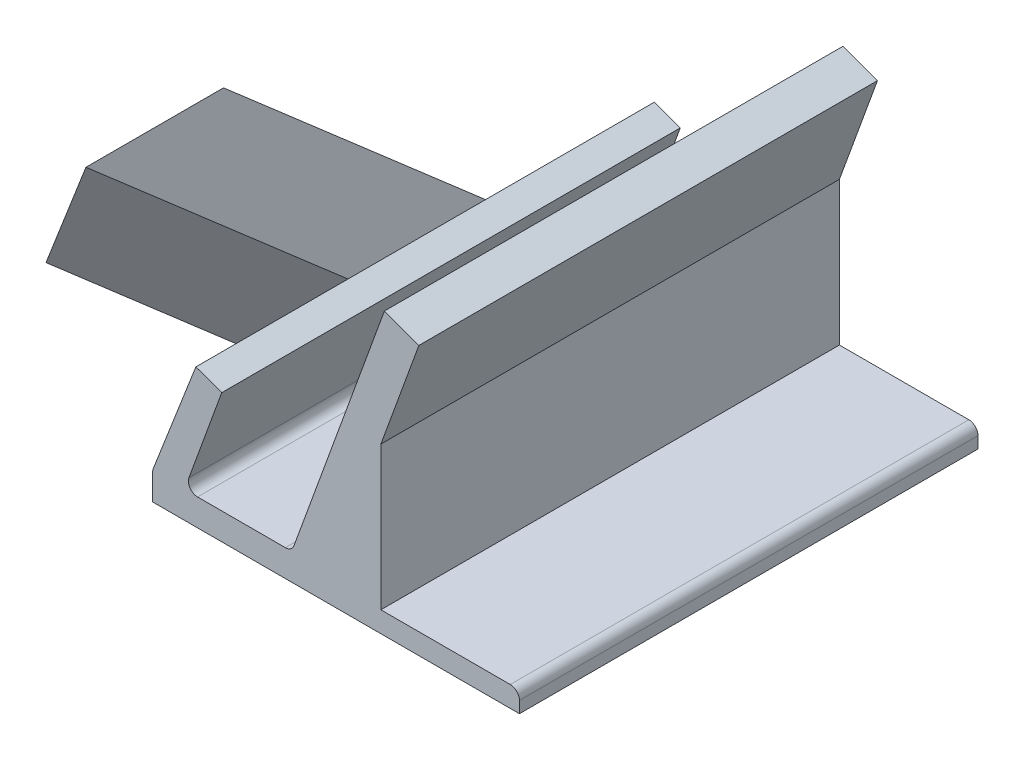
ISO-10303-21;
HEADER;
FILE_DESCRIPTION(('STEP AP214'),'2;1');
FILE_NAME('part.step','',(''),(''),'','','');
FILE_SCHEMA(('AUTOMOTIVE_DESIGN { 1 0 10303 214 1 1 1 1 }'));
ENDSEC;
DATA;
#1=APPLICATION_CONTEXT('core data for automotive mechanical design processes');
#2=APPLICATION_PROTOCOL_DEFINITION('international standard','automotive_design',2000,#1);
#3=PRODUCT_CONTEXT('',#1,'mechanical');
#4=PRODUCT('Part','Part','',(#3));
#5=PRODUCT_RELATED_PRODUCT_CATEGORY('part','',(#4));
#6=PRODUCT_DEFINITION_FORMATION('','',#4);
#7=PRODUCT_DEFINITION_CONTEXT('part definition',#1,'design');
#8=PRODUCT_DEFINITION('design','',#6,#7);
#9=PRODUCT_DEFINITION_SHAPE('','',#8);
#10=(LENGTH_UNIT() NAMED_UNIT(*) SI_UNIT(.MILLI.,.METRE.));
#11=(NAMED_UNIT(*) PLANE_ANGLE_UNIT() SI_UNIT($,.RADIAN.));
#12=(NAMED_UNIT(*) SI_UNIT($,.STERADIAN.) SOLID_ANGLE_UNIT());
#13=UNCERTAINTY_MEASURE_WITH_UNIT(LENGTH_MEASURE(1.E-05),#10,'distance_accuracy_value','');
#14=(GEOMETRIC_REPRESENTATION_CONTEXT(3) GLOBAL_UNCERTAINTY_ASSIGNED_CONTEXT((#13)) GLOBAL_UNIT_ASSIGNED_CONTEXT((#10,
#11,#12)) REPRESENTATION_CONTEXT('',''));
#15=CARTESIAN_POINT('',(0.,0.,0.));
#16=DIRECTION('',(0.,0.,1.));
#17=DIRECTION('',(1.,0.,0.));
#18=AXIS2_PLACEMENT_3D('',#15,#16,#17);
#19=CARTESIAN_POINT('',(-84.4243498751741,-3.74669119484268,50.));
#20=DIRECTION('',(0.93181597119698,-0.362931117186484,0.));
#21=DIRECTION('',(0.362931117186484,0.93181597119698,0.));
#22=AXIS2_PLACEMENT_3D('',#19,#20,#21);
#23=PLANE('',#22);
#24=DIRECTION('',(-0.362931117186484,-0.93181597119698,0.));
#25=VECTOR('',#24,1.);
#26=CARTESIAN_POINT('',(-80.0992581448051,7.35786655840973,17.5));
#27=LINE('',#26,#25);
#28=CARTESIAN_POINT('',(-80.0992581448051,7.35786655840973,17.5));
#29=VERTEX_POINT('',#28);
#30=CARTESIAN_POINT('',(-84.424349875174,-3.74669119484269,17.5));
#31=VERTEX_POINT('',#30);
#32=EDGE_CURVE('E316',#29,#31,#27,.T.);
#33=ORIENTED_EDGE('',*,*,#32,.F.);
#34=DIRECTION('',(0.,0.,1.));
#35=VECTOR('',#34,1.);
#36=CARTESIAN_POINT('',(-80.0992581448051,7.35786655840973,17.5));
#37=LINE('',#36,#35);
#38=CARTESIAN_POINT('',(-80.0992581448051,7.35786655840973,32.5));
#39=VERTEX_POINT('',#38);
#40=EDGE_CURVE('E329',#29,#39,#37,.T.);
#41=ORIENTED_EDGE('',*,*,#40,.T.);
#42=DIRECTION('',(-0.362931117186484,-0.93181597119698,0.));
#43=VECTOR('',#42,1.);
#44=CARTESIAN_POINT('',(-80.0992581448051,7.35786655840973,32.5));
#45=LINE('',#44,#43);
#46=CARTESIAN_POINT('',(-84.4243498751741,-3.74669119484268,32.5));
#47=VERTEX_POINT('',#46);
#48=EDGE_CURVE('E326',#39,#47,#45,.T.);
#49=ORIENTED_EDGE('',*,*,#48,.T.);
#50=DIRECTION('',(0.,0.,-1.));
#51=VECTOR('',#50,1.);
#52=CARTESIAN_POINT('',(-84.4243498751741,-3.74669119484268,50.));
#53=LINE('',#52,#51);
#54=CARTESIAN_POINT('',(-84.4243498751741,-3.74669119484268,50.));
#55=VERTEX_POINT('',#54);
#56=EDGE_CURVE('E181',#55,#47,#53,.T.);
#57=ORIENTED_EDGE('',*,*,#56,.F.);
#58=DIRECTION('',(-0.362931117186488,-0.931815971196978,0.));
#59=VECTOR('',#58,1.);
#60=CARTESIAN_POINT('',(-79.7744293805528,8.1918557538829,50.));
#61=LINE('',#60,#59);
#62=CARTESIAN_POINT('',(-79.7744293805528,8.1918557538829,50.));
#63=VERTEX_POINT('',#62);
#64=EDGE_CURVE('E164',#63,#55,#61,.T.);
#65=ORIENTED_EDGE('',*,*,#64,.F.);
#66=DIRECTION('',(0.,0.,-1.));
#67=VECTOR('',#66,1.);
#68=CARTESIAN_POINT('',(-79.7744293805528,8.1918557538829,50.));
#69=LINE('',#68,#67);
#70=CARTESIAN_POINT('',(-79.7744293805528,8.1918557538829,0.));
#71=VERTEX_POINT('',#70);
#72=EDGE_CURVE('E174',#63,#71,#69,.T.);
#73=ORIENTED_EDGE('',*,*,#72,.T.);
#74=DIRECTION('',(-0.362931117186484,-0.93181597119698,0.));
#75=VECTOR('',#74,1.);
#76=CARTESIAN_POINT('',(-84.4243498751741,-3.74669119484268,0.));
#77=LINE('',#76,#75);
#78=CARTESIAN_POINT('',(-84.4243498751741,-3.74669119484268,0.));
#79=VERTEX_POINT('',#78);
#80=EDGE_CURVE('E223',#71,#79,#77,.T.);
#81=ORIENTED_EDGE('',*,*,#80,.T.);
#82=EDGE_CURVE('E228',#31,#79,#53,.T.);
#83=ORIENTED_EDGE('',*,*,#82,.F.);
#84=EDGE_LOOP('',(#33,#41,#49,#57,#65,#73,#81,#83));
#85=FACE_BOUND('',#84,.T.);
#86=ADVANCED_FACE('F33',(#85),#23,.F.);
#87=CARTESIAN_POINT('',(-84.4925339039771,-6.92175187167785,50.));
#88=DIRECTION('',(1.,0.,0.));
#89=DIRECTION('',(0.,0.,-1.));
#90=AXIS2_PLACEMENT_3D('',#87,#88,#89);
#91=PLANE('',#90);
#92=DIRECTION('',(0.,-1.,0.));
#93=VECTOR('',#92,1.);
#94=CARTESIAN_POINT('',(-84.4925339039771,-6.92175187167785,0.));
#95=LINE('',#94,#93);
#96=CARTESIAN_POINT('',(-84.4925339039771,-4.10962231202917,0.));
#97=VERTEX_POINT('',#96);
#98=CARTESIAN_POINT('',(-84.4925339039771,-6.92175187167785,0.));
#99=VERTEX_POINT('',#98);
#100=EDGE_CURVE('E191',#97,#99,#95,.T.);
#101=ORIENTED_EDGE('',*,*,#100,.T.);
#102=DIRECTION('',(0.,0.,-1.));
#103=VECTOR('',#102,1.);
#104=CARTESIAN_POINT('',(-84.4925339039771,-6.92175187167785,50.));
#105=LINE('',#104,#103);
#106=CARTESIAN_POINT('',(-84.4925339039771,-6.92175187167785,50.));
#107=VERTEX_POINT('',#106);
#108=EDGE_CURVE('E11',#107,#99,#105,.T.);
#109=ORIENTED_EDGE('',*,*,#108,.F.);
#110=DIRECTION('',(0.,-1.,0.));
#111=VECTOR('',#110,1.);
#112=CARTESIAN_POINT('',(-84.4925339039771,-6.92175187167785,50.));
#113=LINE('',#112,#111);
#114=CARTESIAN_POINT('',(-84.4925339039771,-4.10962231202917,50.));
#115=VERTEX_POINT('',#114);
#116=EDGE_CURVE('E226',#115,#107,#113,.T.);
#117=ORIENTED_EDGE('',*,*,#116,.F.);
#118=DIRECTION('',(0.,0.,-1.));
#119=VECTOR('',#118,1.);
#120=CARTESIAN_POINT('',(-84.4925339039771,-4.10962231202917,50.));
#121=LINE('',#120,#119);
#122=EDGE_CURVE('E187',#115,#97,#121,.T.);
#123=ORIENTED_EDGE('',*,*,#122,.T.);
#124=EDGE_LOOP('',(#101,#109,#117,#123));
#125=FACE_BOUND('',#124,.T.);
#126=ADVANCED_FACE('F35',(#125),#91,.F.);
#127=CARTESIAN_POINT('',(-84.4925339039771,-6.92175187167785,50.));
#128=DIRECTION('',(0.,1.,0.));
#129=DIRECTION('',(0.,0.,1.));
#130=AXIS2_PLACEMENT_3D('',#127,#128,#129);
#131=PLANE('',#130);
#132=DIRECTION('',(1.,0.,0.));
#133=VECTOR('',#132,1.);
#134=CARTESIAN_POINT('',(-84.4925339039771,-6.92175187167785,0.));
#135=LINE('',#134,#133);
#136=CARTESIAN_POINT('',(-44.4925339039771,-6.92175187167785,0.));
#137=VERTEX_POINT('',#136);
#138=EDGE_CURVE('E194',#99,#137,#135,.T.);
#139=ORIENTED_EDGE('',*,*,#138,.T.);
#140=DIRECTION('',(0.,0.,-1.));
#141=VECTOR('',#140,1.);
#142=CARTESIAN_POINT('',(-44.4925339039771,-6.92175187167785,50.));
#143=LINE('',#142,#141);
#144=CARTESIAN_POINT('',(-44.4925339039771,-6.92175187167785,50.));
#145=VERTEX_POINT('',#144);
#146=EDGE_CURVE('E41',#145,#137,#143,.T.);
#147=ORIENTED_EDGE('',*,*,#146,.F.);
#148=DIRECTION('',(1.,0.,0.));
#149=VECTOR('',#148,1.);
#150=CARTESIAN_POINT('',(-84.4925339039771,-6.92175187167785,50.));
#151=LINE('',#150,#149);
#152=EDGE_CURVE('E121',#107,#145,#151,.T.);
#153=ORIENTED_EDGE('',*,*,#152,.F.);
#154=ORIENTED_EDGE('',*,*,#108,.T.);
#155=EDGE_LOOP('',(#139,#147,#153,#154));
#156=FACE_BOUND('',#155,.T.);
#157=ADVANCED_FACE('F354',(#156),#131,.F.);
#158=CARTESIAN_POINT('',(-44.4925339039771,-6.92175187167785,50.));
#159=DIRECTION('',(-1.,0.,0.));
#160=DIRECTION('',(0.,0.,1.));
#161=AXIS2_PLACEMENT_3D('',#158,#159,#160);
#162=PLANE('',#161);
#163=DIRECTION('',(0.,1.,0.));
#164=VECTOR('',#163,1.);
#165=CARTESIAN_POINT('',(-44.4925339039771,-6.92175187167785,0.));
#166=LINE('',#165,#164);
#167=CARTESIAN_POINT('',(-44.4925339039771,-5.66093221664552,0.));
#168=VERTEX_POINT('',#167);
#169=EDGE_CURVE('E197',#137,#168,#166,.T.);
#170=ORIENTED_EDGE('',*,*,#169,.T.);
#171=DIRECTION('',(0.,0.,-1.));
#172=VECTOR('',#171,1.);
#173=CARTESIAN_POINT('',(-44.4925339039771,-5.66093221664552,50.));
#174=LINE('',#173,#172);
#175=CARTESIAN_POINT('',(-44.4925339039771,-5.66093221664552,50.));
#176=VERTEX_POINT('',#175);
#177=EDGE_CURVE('E259',#176,#168,#174,.T.);
#178=ORIENTED_EDGE('',*,*,#177,.F.);
#179=DIRECTION('',(0.,1.,0.));
#180=VECTOR('',#179,1.);
#181=CARTESIAN_POINT('',(-44.4925339039771,-6.92175187167785,50.));
#182=LINE('',#181,#180);
#183=EDGE_CURVE('E267',#145,#176,#182,.T.);
#184=ORIENTED_EDGE('',*,*,#183,.F.);
#185=ORIENTED_EDGE('',*,*,#146,.T.);
#186=EDGE_LOOP('',(#170,#178,#184,#185));
#187=FACE_BOUND('',#186,.T.);
#188=ADVANCED_FACE('F265',(#187),#162,.F.);
#189=CARTESIAN_POINT('',(-45.4925339039771,-5.66093221664551,50.));
#190=DIRECTION('',(0.,0.,-1.));
#191=DIRECTION('',(-1.,0.,0.));
#192=AXIS2_PLACEMENT_3D('',#189,#190,#191);
#193=CYLINDRICAL_SURFACE('',#192,1.);
#194=CARTESIAN_POINT('',(-45.4925339039771,-5.66093221664551,0.));
#195=DIRECTION('',(0.,0.,1.));
#196=DIRECTION('',(1.,0.,0.));
#197=AXIS2_PLACEMENT_3D('',#194,#195,#196);
#198=CIRCLE('',#197,1.);
#199=CARTESIAN_POINT('',(-45.4925339039771,-4.66093221664551,0.));
#200=VERTEX_POINT('',#199);
#201=EDGE_CURVE('E199',#168,#200,#198,.T.);
#202=ORIENTED_EDGE('',*,*,#201,.T.);
#203=DIRECTION('',(0.,0.,-1.));
#204=VECTOR('',#203,1.);
#205=CARTESIAN_POINT('',(-45.4925339039771,-4.66093221664551,50.));
#206=LINE('',#205,#204);
#207=CARTESIAN_POINT('',(-45.4925339039771,-4.66093221664551,50.));
#208=VERTEX_POINT('',#207);
#209=EDGE_CURVE('E256',#208,#200,#206,.T.);
#210=ORIENTED_EDGE('',*,*,#209,.F.);
#211=CARTESIAN_POINT('',(-45.4925339039771,-5.66093221664551,50.));
#212=DIRECTION('',(0.,0.,1.));
#213=DIRECTION('',(1.,0.,0.));
#214=AXIS2_PLACEMENT_3D('',#211,#212,#213);
#215=CIRCLE('',#214,1.);
#216=EDGE_CURVE('E285',#176,#208,#215,.T.);
#217=ORIENTED_EDGE('',*,*,#216,.F.);
#218=ORIENTED_EDGE('',*,*,#177,.T.);
#219=EDGE_LOOP('',(#202,#210,#217,#218));
#220=FACE_BOUND('',#219,.T.);
#221=ADVANCED_FACE('F276',(#220),#193,.T.);
#222=CARTESIAN_POINT('',(-45.4925339039771,-4.66093221664551,50.));
#223=DIRECTION('',(0.,-1.,0.));
#224=DIRECTION('',(0.,0.,-1.));
#225=AXIS2_PLACEMENT_3D('',#222,#223,#224);
#226=PLANE('',#225);
#227=DIRECTION('',(-1.,0.,0.));
#228=VECTOR('',#227,1.);
#229=CARTESIAN_POINT('',(-45.4925339039771,-4.66093221664551,0.));
#230=LINE('',#229,#228);
#231=CARTESIAN_POINT('',(-59.6020973536628,-4.66093221664551,0.));
#232=VERTEX_POINT('',#231);
#233=EDGE_CURVE('E201',#200,#232,#230,.T.);
#234=ORIENTED_EDGE('',*,*,#233,.T.);
#235=DIRECTION('',(0.,0.,-1.));
#236=VECTOR('',#235,1.);
#237=CARTESIAN_POINT('',(-59.6020973536628,-4.66093221664551,50.));
#238=LINE('',#237,#236);
#239=CARTESIAN_POINT('',(-59.6020973536628,-4.66093221664551,50.));
#240=VERTEX_POINT('',#239);
#241=EDGE_CURVE('E253',#240,#232,#238,.T.);
#242=ORIENTED_EDGE('',*,*,#241,.F.);
#243=DIRECTION('',(-1.,0.,0.));
#244=VECTOR('',#243,1.);
#245=CARTESIAN_POINT('',(-45.4925339039771,-4.66093221664551,50.));
#246=LINE('',#245,#244);
#247=EDGE_CURVE('E282',#208,#240,#246,.T.);
#248=ORIENTED_EDGE('',*,*,#247,.F.);
#249=ORIENTED_EDGE('',*,*,#209,.T.);
#250=EDGE_LOOP('',(#234,#242,#248,#249));
#251=FACE_BOUND('',#250,.T.);
#252=ADVANCED_FACE('F280',(#251),#226,.F.);
#253=CARTESIAN_POINT('',(-59.6020973536628,-4.66093221664551,50.));
#254=DIRECTION('',(-1.,0.,0.));
#255=DIRECTION('',(0.,-1.,0.));
#256=AXIS2_PLACEMENT_3D('',#253,#254,#255);
#257=PLANE('',#256);
#258=DIRECTION('',(0.,1.,0.));
#259=VECTOR('',#258,1.);
#260=CARTESIAN_POINT('',(-59.6020973536628,-4.66093221664551,0.));
#261=LINE('',#260,#259);
#262=CARTESIAN_POINT('',(-59.6020973536625,10.9864032925687,0.));
#263=VERTEX_POINT('',#262);
#264=EDGE_CURVE('E203',#232,#263,#261,.T.);
#265=ORIENTED_EDGE('',*,*,#264,.T.);
#266=DIRECTION('',(0.,0.,-1.));
#267=VECTOR('',#266,1.);
#268=CARTESIAN_POINT('',(-59.6020973536625,10.9864032925687,50.));
#269=LINE('',#268,#267);
#270=CARTESIAN_POINT('',(-59.6020973536625,10.9864032925687,50.));
#271=VERTEX_POINT('',#270);
#272=EDGE_CURVE('E250',#271,#263,#269,.T.);
#273=ORIENTED_EDGE('',*,*,#272,.F.);
#274=DIRECTION('',(0.,1.,0.));
#275=VECTOR('',#274,1.);
#276=CARTESIAN_POINT('',(-59.6020973536628,-4.66093221664551,50.));
#277=LINE('',#276,#275);
#278=EDGE_CURVE('E284',#240,#271,#277,.T.);
#279=ORIENTED_EDGE('',*,*,#278,.F.);
#280=ORIENTED_EDGE('',*,*,#241,.T.);
#281=EDGE_LOOP('',(#265,#273,#279,#280));
#282=FACE_BOUND('',#281,.T.);
#283=ADVANCED_FACE('F393',(#282),#257,.F.);
#284=CARTESIAN_POINT('',(-55.4557081069991,22.3785141200469,50.));
#285=DIRECTION('',(-0.939692620785907,0.342020143325671,0.));
#286=DIRECTION('',(-0.342020143325671,-0.939692620785908,0.));
#287=AXIS2_PLACEMENT_3D('',#284,#285,#286);
#288=PLANE('',#287);
#289=DIRECTION('',(0.342020143325671,0.939692620785907,0.));
#290=VECTOR('',#289,1.);
#291=CARTESIAN_POINT('',(-55.4557081069991,22.3785141200469,0.));
#292=LINE('',#291,#290);
#293=CARTESIAN_POINT('',(-55.4557081069991,22.3785141200469,0.));
#294=VERTEX_POINT('',#293);
#295=EDGE_CURVE('E206',#263,#294,#292,.T.);
#296=ORIENTED_EDGE('',*,*,#295,.T.);
#297=DIRECTION('',(0.,0.,-1.));
#298=VECTOR('',#297,1.);
#299=CARTESIAN_POINT('',(-55.4557081069991,22.3785141200469,50.));
#300=LINE('',#299,#298);
#301=CARTESIAN_POINT('',(-55.4557081069991,22.3785141200469,50.));
#302=VERTEX_POINT('',#301);
#303=EDGE_CURVE('E247',#302,#294,#300,.T.);
#304=ORIENTED_EDGE('',*,*,#303,.F.);
#305=DIRECTION('',(0.342020143325638,0.93969262078592,0.));
#306=VECTOR('',#305,1.);
#307=CARTESIAN_POINT('',(-59.6020973536625,10.9864032925687,50.));
#308=LINE('',#307,#306);
#309=EDGE_CURVE('E287',#271,#302,#308,.T.);
#310=ORIENTED_EDGE('',*,*,#309,.F.);
#311=ORIENTED_EDGE('',*,*,#272,.T.);
#312=EDGE_LOOP('',(#296,#304,#310,#311));
#313=FACE_BOUND('',#312,.T.);
#314=ADVANCED_FACE('F389',(#313),#288,.F.);
#315=CARTESIAN_POINT('',(-59.2144785901427,23.7465946933495,50.));
#316=DIRECTION('',(-0.34202014332567,-0.939692620785908,0.));
#317=DIRECTION('',(0.939692620785908,-0.34202014332567,0.));
#318=AXIS2_PLACEMENT_3D('',#315,#316,#317);
#319=PLANE('',#318);
#320=DIRECTION('',(-0.939692620785908,0.34202014332567,0.));
#321=VECTOR('',#320,1.);
#322=CARTESIAN_POINT('',(-59.2144785901427,23.7465946933495,0.));
#323=LINE('',#322,#321);
#324=CARTESIAN_POINT('',(-59.2144785901427,23.7465946933495,0.));
#325=VERTEX_POINT('',#324);
#326=EDGE_CURVE('E208',#294,#325,#323,.T.);
#327=ORIENTED_EDGE('',*,*,#326,.T.);
#328=DIRECTION('',(0.,0.,-1.));
#329=VECTOR('',#328,1.);
#330=CARTESIAN_POINT('',(-59.2144785901427,23.7465946933495,50.));
#331=LINE('',#330,#329);
#332=CARTESIAN_POINT('',(-59.2144785901427,23.7465946933495,50.));
#333=VERTEX_POINT('',#332);
#334=EDGE_CURVE('E244',#333,#325,#331,.T.);
#335=ORIENTED_EDGE('',*,*,#334,.F.);
#336=DIRECTION('',(-0.939692620785908,0.34202014332567,0.));
#337=VECTOR('',#336,1.);
#338=CARTESIAN_POINT('',(-59.2144785901427,23.7465946933495,50.));
#339=LINE('',#338,#337);
#340=EDGE_CURVE('E293',#302,#333,#339,.T.);
#341=ORIENTED_EDGE('',*,*,#340,.F.);
#342=ORIENTED_EDGE('',*,*,#303,.T.);
#343=EDGE_LOOP('',(#327,#335,#341,#342));
#344=FACE_BOUND('',#343,.T.);
#345=ADVANCED_FACE('F385',(#344),#319,.F.);
#346=CARTESIAN_POINT('',(-69.0737024940638,-3.34140035602092,50.));
#347=DIRECTION('',(0.939692620785908,-0.34202014332567,0.));
#348=DIRECTION('',(0.34202014332567,0.939692620785908,0.));
#349=AXIS2_PLACEMENT_3D('',#346,#347,#348);
#350=PLANE('',#349);
#351=DIRECTION('',(-0.34202014332567,-0.939692620785908,0.));
#352=VECTOR('',#351,1.);
#353=CARTESIAN_POINT('',(-69.0737024940638,-3.34140035602092,0.));
#354=LINE('',#353,#352);
#355=CARTESIAN_POINT('',(-69.0737024940638,-3.34140035602092,0.));
#356=VERTEX_POINT('',#355);
#357=EDGE_CURVE('E211',#325,#356,#354,.T.);
#358=ORIENTED_EDGE('',*,*,#357,.T.);
#359=DIRECTION('',(0.,0.,-1.));
#360=VECTOR('',#359,1.);
#361=CARTESIAN_POINT('',(-69.0737024940638,-3.34140035602092,50.));
#362=LINE('',#361,#360);
#363=CARTESIAN_POINT('',(-69.0737024940638,-3.34140035602092,50.));
#364=VERTEX_POINT('',#363);
#365=EDGE_CURVE('E241',#364,#356,#362,.T.);
#366=ORIENTED_EDGE('',*,*,#365,.F.);
#367=DIRECTION('',(-0.34202014332567,-0.939692620785908,0.));
#368=VECTOR('',#367,1.);
#369=CARTESIAN_POINT('',(-59.5564987334684,22.8069020725636,50.));
#370=LINE('',#369,#368);
#371=EDGE_CURVE('E295',#333,#364,#370,.T.);
#372=ORIENTED_EDGE('',*,*,#371,.F.);
#373=ORIENTED_EDGE('',*,*,#334,.T.);
#374=EDGE_LOOP('',(#358,#366,#372,#373));
#375=FACE_BOUND('',#374,.T.);
#376=ADVANCED_FACE('F381',(#375),#350,.F.);
#377=CARTESIAN_POINT('',(-70.0133951148497,-2.99938021269526,50.));
#378=DIRECTION('',(0.,0.,-1.));
#379=DIRECTION('',(-1.,0.,0.));
#380=AXIS2_PLACEMENT_3D('',#377,#378,#379);
#381=CYLINDRICAL_SURFACE('',#380,1.);
#382=CARTESIAN_POINT('',(-70.0133951148497,-2.99938021269526,0.));
#383=DIRECTION('',(0.,0.,-1.));
#384=DIRECTION('',(1.,0.,0.));
#385=AXIS2_PLACEMENT_3D('',#382,#383,#384);
#386=CIRCLE('',#385,1.);
#387=CARTESIAN_POINT('',(-70.0133951148497,-3.99938021269526,0.));
#388=VERTEX_POINT('',#387);
#389=EDGE_CURVE('E213',#356,#388,#386,.T.);
#390=ORIENTED_EDGE('',*,*,#389,.T.);
#391=DIRECTION('',(0.,0.,-1.));
#392=VECTOR('',#391,1.);
#393=CARTESIAN_POINT('',(-70.0133951148497,-3.99938021269526,50.));
#394=LINE('',#393,#392);
#395=CARTESIAN_POINT('',(-70.0133951148497,-3.99938021269526,50.));
#396=VERTEX_POINT('',#395);
#397=EDGE_CURVE('E238',#396,#388,#394,.T.);
#398=ORIENTED_EDGE('',*,*,#397,.F.);
#399=CARTESIAN_POINT('',(-70.0133951148497,-2.99938021269526,50.));
#400=DIRECTION('',(0.,0.,-1.));
#401=DIRECTION('',(1.,0.,0.));
#402=AXIS2_PLACEMENT_3D('',#399,#400,#401);
#403=CIRCLE('',#402,1.);
#404=EDGE_CURVE('E297',#364,#396,#403,.T.);
#405=ORIENTED_EDGE('',*,*,#404,.F.);
#406=ORIENTED_EDGE('',*,*,#365,.T.);
#407=EDGE_LOOP('',(#390,#398,#405,#406));
#408=FACE_BOUND('',#407,.T.);
#409=ADVANCED_FACE('F377',(#408),#381,.F.);
#410=CARTESIAN_POINT('',(-79.590995067133,-3.99938021269526,50.));
#411=DIRECTION('',(0.,-1.,0.));
#412=DIRECTION('',(1.,0.,0.));
#413=AXIS2_PLACEMENT_3D('',#410,#411,#412);
#414=PLANE('',#413);
#415=DIRECTION('',(-1.,0.,0.));
#416=VECTOR('',#415,1.);
#417=CARTESIAN_POINT('',(-79.590995067133,-3.99938021269526,0.));
#418=LINE('',#417,#416);
#419=CARTESIAN_POINT('',(-79.590995067133,-3.99938021269526,0.));
#420=VERTEX_POINT('',#419);
#421=EDGE_CURVE('E215',#388,#420,#418,.T.);
#422=ORIENTED_EDGE('',*,*,#421,.T.);
#423=DIRECTION('',(0.,0.,-1.));
#424=VECTOR('',#423,1.);
#425=CARTESIAN_POINT('',(-79.590995067133,-3.99938021269526,50.));
#426=LINE('',#425,#424);
#427=CARTESIAN_POINT('',(-79.590995067133,-3.99938021269526,50.));
#428=VERTEX_POINT('',#427);
#429=EDGE_CURVE('E235',#428,#420,#426,.T.);
#430=ORIENTED_EDGE('',*,*,#429,.F.);
#431=DIRECTION('',(-1.,0.,0.));
#432=VECTOR('',#431,1.);
#433=CARTESIAN_POINT('',(-79.590995067133,-3.99938021269526,50.));
#434=LINE('',#433,#432);
#435=EDGE_CURVE('E299',#396,#428,#434,.T.);
#436=ORIENTED_EDGE('',*,*,#435,.F.);
#437=ORIENTED_EDGE('',*,*,#397,.T.);
#438=EDGE_LOOP('',(#422,#430,#436,#437));
#439=FACE_BOUND('',#438,.T.);
#440=ADVANCED_FACE('F374',(#439),#414,.F.);
#441=CARTESIAN_POINT('',(-79.590995067133,-2.99938021269526,50.));
#442=DIRECTION('',(0.,0.,-1.));
#443=DIRECTION('',(-1.,0.,0.));
#444=AXIS2_PLACEMENT_3D('',#441,#442,#443);
#445=CYLINDRICAL_SURFACE('',#444,0.999999999999998);
#446=CARTESIAN_POINT('',(-79.590995067133,-2.99938021269526,0.));
#447=DIRECTION('',(0.,0.,-1.));
#448=DIRECTION('',(1.,0.,0.));
#449=AXIS2_PLACEMENT_3D('',#446,#447,#448);
#450=CIRCLE('',#449,0.999999999999998);
#451=CARTESIAN_POINT('',(-80.5306876879189,-2.65736006936958,0.));
#452=VERTEX_POINT('',#451);
#453=EDGE_CURVE('E217',#420,#452,#450,.T.);
#454=ORIENTED_EDGE('',*,*,#453,.T.);
#455=DIRECTION('',(0.,0.,-1.));
#456=VECTOR('',#455,1.);
#457=CARTESIAN_POINT('',(-80.5306876879189,-2.65736006936958,50.));
#458=LINE('',#457,#456);
#459=CARTESIAN_POINT('',(-80.5306876879189,-2.65736006936958,50.));
#460=VERTEX_POINT('',#459);
#461=EDGE_CURVE('E232',#460,#452,#458,.T.);
#462=ORIENTED_EDGE('',*,*,#461,.F.);
#463=CARTESIAN_POINT('',(-79.590995067133,-2.99938021269526,50.));
#464=DIRECTION('',(0.,0.,-1.));
#465=DIRECTION('',(1.,0.,0.));
#466=AXIS2_PLACEMENT_3D('',#463,#464,#465);
#467=CIRCLE('',#466,0.999999999999998);
#468=EDGE_CURVE('E301',#428,#460,#467,.T.);
#469=ORIENTED_EDGE('',*,*,#468,.F.);
#470=ORIENTED_EDGE('',*,*,#429,.T.);
#471=EDGE_LOOP('',(#454,#462,#469,#470));
#472=FACE_BOUND('',#471,.T.);
#473=ADVANCED_FACE('F307',(#472),#445,.F.);
#474=CARTESIAN_POINT('',(-77.2973716615207,6.22610270311999,50.));
#475=DIRECTION('',(-0.939692620785908,0.34202014332567,0.));
#476=DIRECTION('',(-0.34202014332567,-0.939692620785908,0.));
#477=AXIS2_PLACEMENT_3D('',#474,#475,#476);
#478=PLANE('',#477);
#479=DIRECTION('',(0.34202014332567,0.939692620785908,0.));
#480=VECTOR('',#479,1.);
#481=CARTESIAN_POINT('',(-77.2973716615207,6.22610270311999,0.));
#482=LINE('',#481,#480);
#483=CARTESIAN_POINT('',(-76.9553515181951,7.1657953239059,0.));
#484=VERTEX_POINT('',#483);
#485=EDGE_CURVE('E220',#452,#484,#482,.T.);
#486=ORIENTED_EDGE('',*,*,#485,.T.);
#487=DIRECTION('',(0.,0.,-1.));
#488=VECTOR('',#487,1.);
#489=CARTESIAN_POINT('',(-76.9553515181951,7.1657953239059,50.));
#490=LINE('',#489,#488);
#491=CARTESIAN_POINT('',(-76.9553515181951,7.1657953239059,50.));
#492=VERTEX_POINT('',#491);
#493=EDGE_CURVE('E180',#492,#484,#490,.T.);
#494=ORIENTED_EDGE('',*,*,#493,.F.);
#495=DIRECTION('',(0.342020143325669,0.939692620785908,0.));
#496=VECTOR('',#495,1.);
#497=CARTESIAN_POINT('',(-77.2973716615207,6.22610270311999,50.));
#498=LINE('',#497,#496);
#499=EDGE_CURVE('E167',#460,#492,#498,.T.);
#500=ORIENTED_EDGE('',*,*,#499,.F.);
#501=ORIENTED_EDGE('',*,*,#461,.T.);
#502=EDGE_LOOP('',(#486,#494,#500,#501));
#503=FACE_BOUND('',#502,.T.);
#504=ADVANCED_FACE('F310',(#503),#478,.F.);
#505=CARTESIAN_POINT('',(-76.9553515181951,7.1657953239059,50.));
#506=DIRECTION('',(-0.342020143325669,-0.939692620785908,0.));
#507=DIRECTION('',(0.939692620785908,-0.342020143325669,0.));
#508=AXIS2_PLACEMENT_3D('',#505,#506,#507);
#509=PLANE('',#508);
#510=DIRECTION('',(-0.939692620785908,0.342020143325669,0.));
#511=VECTOR('',#510,1.);
#512=CARTESIAN_POINT('',(-76.9553515181951,7.1657953239059,0.));
#513=LINE('',#512,#511);
#514=EDGE_CURVE('E177',#484,#71,#513,.T.);
#515=ORIENTED_EDGE('',*,*,#514,.T.);
#516=ORIENTED_EDGE('',*,*,#72,.F.);
#517=DIRECTION('',(-0.939692620785908,0.342020143325669,0.));
#518=VECTOR('',#517,1.);
#519=CARTESIAN_POINT('',(-76.9553515181951,7.1657953239059,50.));
#520=LINE('',#519,#518);
#521=EDGE_CURVE('E160',#492,#63,#520,.T.);
#522=ORIENTED_EDGE('',*,*,#521,.F.);
#523=ORIENTED_EDGE('',*,*,#493,.T.);
#524=EDGE_LOOP('',(#515,#516,#522,#523));
#525=FACE_BOUND('',#524,.T.);
#526=ADVANCED_FACE('F175',(#525),#509,.F.);
#527=CARTESIAN_POINT('',(-83.4925339039771,-4.10962231202917,50.));
#528=DIRECTION('',(0.,0.,-1.));
#529=DIRECTION('',(-1.,0.,0.));
#530=AXIS2_PLACEMENT_3D('',#527,#528,#529);
#531=CYLINDRICAL_SURFACE('',#530,1.);
#532=CARTESIAN_POINT('',(-83.4925339039771,-4.10962231202917,0.));
#533=DIRECTION('',(0.,0.,1.));
#534=DIRECTION('',(-1.,0.,0.));
#535=AXIS2_PLACEMENT_3D('',#532,#533,#534);
#536=CIRCLE('',#535,1.);
#537=EDGE_CURVE('E113',#79,#97,#536,.T.);
#538=ORIENTED_EDGE('',*,*,#537,.T.);
#539=ORIENTED_EDGE('',*,*,#122,.F.);
#540=CARTESIAN_POINT('',(-83.4925339039771,-4.10962231202917,50.));
#541=DIRECTION('',(0.,0.,1.));
#542=DIRECTION('',(-1.,0.,0.));
#543=AXIS2_PLACEMENT_3D('',#540,#541,#542);
#544=CIRCLE('',#543,1.);
#545=EDGE_CURVE('E57',#55,#115,#544,.T.);
#546=ORIENTED_EDGE('',*,*,#545,.F.);
#547=ORIENTED_EDGE('',*,*,#56,.T.);
#548=EDGE_CURVE('E229',#47,#31,#53,.T.);
#549=ORIENTED_EDGE('',*,*,#548,.T.);
#550=ORIENTED_EDGE('',*,*,#82,.T.);
#551=EDGE_LOOP('',(#538,#539,#546,#547,#549,#550));
#552=FACE_BOUND('',#551,.T.);
#553=ADVANCED_FACE('F319',(#552),#531,.T.);
#554=CARTESIAN_POINT('',(-83.4925339039771,-4.10962231202917,50.));
#555=DIRECTION('',(0.,0.,-1.));
#556=DIRECTION('',(-1.,0.,0.));
#557=AXIS2_PLACEMENT_3D('',#554,#555,#556);
#558=PLANE('',#557);
#559=ORIENTED_EDGE('',*,*,#116,.T.);
#560=ORIENTED_EDGE('',*,*,#152,.T.);
#561=ORIENTED_EDGE('',*,*,#183,.T.);
#562=ORIENTED_EDGE('',*,*,#216,.T.);
#563=ORIENTED_EDGE('',*,*,#247,.T.);
#564=ORIENTED_EDGE('',*,*,#278,.T.);
#565=ORIENTED_EDGE('',*,*,#309,.T.);
#566=ORIENTED_EDGE('',*,*,#340,.T.);
#567=ORIENTED_EDGE('',*,*,#371,.T.);
#568=ORIENTED_EDGE('',*,*,#404,.T.);
#569=ORIENTED_EDGE('',*,*,#435,.T.);
#570=ORIENTED_EDGE('',*,*,#468,.T.);
#571=ORIENTED_EDGE('',*,*,#499,.T.);
#572=ORIENTED_EDGE('',*,*,#521,.T.);
#573=ORIENTED_EDGE('',*,*,#64,.T.);
#574=ORIENTED_EDGE('',*,*,#545,.T.);
#575=EDGE_LOOP('',(#559,#560,#561,#562,#563,#564,#565,#566,#567,#568,#569,#570,#571,#572,#573,#574));
#576=FACE_BOUND('',#575,.T.);
#577=ADVANCED_FACE('F162',(#576),#558,.F.);
#578=CARTESIAN_POINT('',(-83.4925339039771,-4.10962231202917,0.));
#579=DIRECTION('',(0.,0.,-1.));
#580=DIRECTION('',(-1.,0.,0.));
#581=AXIS2_PLACEMENT_3D('',#578,#579,#580);
#582=PLANE('',#581);
#583=ORIENTED_EDGE('',*,*,#100,.F.);
#584=ORIENTED_EDGE('',*,*,#537,.F.);
#585=ORIENTED_EDGE('',*,*,#80,.F.);
#586=ORIENTED_EDGE('',*,*,#514,.F.);
#587=ORIENTED_EDGE('',*,*,#485,.F.);
#588=ORIENTED_EDGE('',*,*,#453,.F.);
#589=ORIENTED_EDGE('',*,*,#421,.F.);
#590=ORIENTED_EDGE('',*,*,#389,.F.);
#591=ORIENTED_EDGE('',*,*,#357,.F.);
#592=ORIENTED_EDGE('',*,*,#326,.F.);
#593=ORIENTED_EDGE('',*,*,#295,.F.);
#594=ORIENTED_EDGE('',*,*,#264,.F.);
#595=ORIENTED_EDGE('',*,*,#233,.F.);
#596=ORIENTED_EDGE('',*,*,#201,.F.);
#597=ORIENTED_EDGE('',*,*,#169,.F.);
#598=ORIENTED_EDGE('',*,*,#138,.F.);
#599=EDGE_LOOP('',(#583,#584,#585,#586,#587,#588,#589,#590,#591,#592,#593,#594,#595,#596,#597,#598));
#600=FACE_BOUND('',#599,.T.);
#601=ADVANCED_FACE('F271',(#600),#582,.T.);
#602=CARTESIAN_POINT('',(-72.0369844820863,28.0575393264023,0.));
#603=DIRECTION('',(0.93181597119698,-0.362931117186484,0.));
#604=DIRECTION('',(0.362931117186484,0.93181597119698,0.));
#605=AXIS2_PLACEMENT_3D('',#602,#603,#604);
#606=PLANE('',#605);
#607=ORIENTED_EDGE('',*,*,#548,.F.);
#608=CARTESIAN_POINT('',(-84.4544315510429,-3.82392509595402,32.5));
#609=VERTEX_POINT('',#608);
#610=EDGE_CURVE('E48',#47,#609,#45,.T.);
#611=ORIENTED_EDGE('',*,*,#610,.T.);
#612=DIRECTION('',(0.,0.,1.));
#613=VECTOR('',#612,1.);
#614=CARTESIAN_POINT('',(-84.4544315510429,-3.82392509595402,17.5));
#615=LINE('',#614,#613);
#616=CARTESIAN_POINT('',(-84.4544315510429,-3.82392509595402,17.5));
#617=VERTEX_POINT('',#616);
#618=EDGE_CURVE('E333',#617,#609,#615,.T.);
#619=ORIENTED_EDGE('',*,*,#618,.F.);
#620=EDGE_CURVE('E325',#31,#617,#27,.T.);
#621=ORIENTED_EDGE('',*,*,#620,.F.);
#622=EDGE_LOOP('',(#607,#611,#619,#621));
#623=FACE_BOUND('',#622,.T.);
#624=ADVANCED_FACE('F321',(#623),#606,.T.);
#625=CARTESIAN_POINT('',(-91.1151093338755,14.8679279816111,40.));
#626=DIRECTION('',(0.941980853070373,0.335666609076345,0.));
#627=DIRECTION('',(-0.335666609076345,0.941980853070373,0.));
#628=AXIS2_PLACEMENT_3D('',#625,#626,#627);
#629=PLANE('',#628);
#630=ORIENTED_EDGE('',*,*,#618,.T.);
#631=DIRECTION('',(0.222022592761086,-0.623061769252171,-0.75));
#632=VECTOR('',#631,1.);
#633=CARTESIAN_POINT('',(-91.1151093338755,14.8679279816111,55.));
#634=LINE('',#633,#632);
#635=CARTESIAN_POINT('',(-91.1151093338755,14.8679279816111,55.));
#636=VERTEX_POINT('',#635);
#637=EDGE_CURVE('E195',#636,#609,#634,.T.);
#638=ORIENTED_EDGE('',*,*,#637,.F.);
#639=DIRECTION('',(0.,0.,1.));
#640=VECTOR('',#639,1.);
#641=CARTESIAN_POINT('',(-91.1151093338755,14.8679279816111,40.));
#642=LINE('',#641,#640);
#643=CARTESIAN_POINT('',(-91.1151093338755,14.8679279816111,40.));
#644=VERTEX_POINT('',#643);
#645=EDGE_CURVE('E338',#644,#636,#642,.T.);
#646=ORIENTED_EDGE('',*,*,#645,.F.);
#647=DIRECTION('',(0.222022592761086,-0.623061769252171,-0.75));
#648=VECTOR('',#647,1.);
#649=CARTESIAN_POINT('',(-91.1151093338755,14.8679279816111,40.));
#650=LINE('',#649,#648);
#651=EDGE_CURVE('E339',#644,#617,#650,.T.);
#652=ORIENTED_EDGE('',*,*,#651,.T.);
#653=EDGE_LOOP('',(#630,#638,#646,#652));
#654=FACE_BOUND('',#653,.T.);
#655=ADVANCED_FACE('F467',(#654),#629,.F.);
#656=CARTESIAN_POINT('',(-86.7599359276377,26.0497196359749,55.));
#657=DIRECTION('',(0.806976302708652,-0.314307567307362,0.500000000000002));
#658=DIRECTION('',(0.526692121244319,0.,-0.850056121335032));
#659=AXIS2_PLACEMENT_3D('',#656,#657,#658);
#660=PLANE('',#659);
#661=ORIENTED_EDGE('',*,*,#48,.F.);
#662=DIRECTION('',(0.222022592761086,-0.623061769252171,-0.75));
#663=VECTOR('',#662,1.);
#664=CARTESIAN_POINT('',(-86.7599359276377,26.0497196359749,55.));
#665=LINE('',#664,#663);
#666=CARTESIAN_POINT('',(-86.7599359276377,26.0497196359749,55.));
#667=VERTEX_POINT('',#666);
#668=EDGE_CURVE('E346',#667,#39,#665,.T.);
#669=ORIENTED_EDGE('',*,*,#668,.F.);
#670=DIRECTION('',(-0.362931117186484,-0.93181597119698,0.));
#671=VECTOR('',#670,1.);
#672=CARTESIAN_POINT('',(-86.7599359276377,26.0497196359749,55.));
#673=LINE('',#672,#671);
#674=EDGE_CURVE('E587',#667,#636,#673,.T.);
#675=ORIENTED_EDGE('',*,*,#674,.T.);
#676=ORIENTED_EDGE('',*,*,#637,.T.);
#677=ORIENTED_EDGE('',*,*,#610,.F.);
#678=EDGE_LOOP('',(#661,#669,#675,#676,#677));
#679=FACE_BOUND('',#678,.T.);
#680=ADVANCED_FACE('F474',(#679),#660,.T.);
#681=CARTESIAN_POINT('',(-86.7599359276377,26.0497196359749,40.));
#682=DIRECTION('',(0.941980853070373,0.335666609076345,0.));
#683=DIRECTION('',(-0.335666609076345,0.941980853070373,0.));
#684=AXIS2_PLACEMENT_3D('',#681,#682,#683);
#685=PLANE('',#684);
#686=ORIENTED_EDGE('',*,*,#40,.F.);
#687=DIRECTION('',(0.222022592761086,-0.623061769252171,-0.75));
#688=VECTOR('',#687,1.);
#689=CARTESIAN_POINT('',(-86.7599359276377,26.0497196359749,40.));
#690=LINE('',#689,#688);
#691=CARTESIAN_POINT('',(-86.7599359276377,26.0497196359749,40.));
#692=VERTEX_POINT('',#691);
#693=EDGE_CURVE('E342',#692,#29,#690,.T.);
#694=ORIENTED_EDGE('',*,*,#693,.F.);
#695=DIRECTION('',(0.,0.,1.));
#696=VECTOR('',#695,1.);
#697=CARTESIAN_POINT('',(-86.7599359276377,26.0497196359749,40.));
#698=LINE('',#697,#696);
#699=EDGE_CURVE('E595',#692,#667,#698,.T.);
#700=ORIENTED_EDGE('',*,*,#699,.T.);
#701=ORIENTED_EDGE('',*,*,#668,.T.);
#702=EDGE_LOOP('',(#686,#694,#700,#701));
#703=FACE_BOUND('',#702,.T.);
#704=ADVANCED_FACE('F482',(#703),#685,.T.);
#705=CARTESIAN_POINT('',(-86.7599359276377,26.0497196359749,40.));
#706=DIRECTION('',(0.806976302708652,-0.314307567307362,0.500000000000002));
#707=DIRECTION('',(0.526692121244319,0.,-0.850056121335033));
#708=AXIS2_PLACEMENT_3D('',#705,#706,#707);
#709=PLANE('',#708);
#710=ORIENTED_EDGE('',*,*,#32,.T.);
#711=ORIENTED_EDGE('',*,*,#620,.T.);
#712=ORIENTED_EDGE('',*,*,#651,.F.);
#713=DIRECTION('',(-0.362931117186484,-0.93181597119698,0.));
#714=VECTOR('',#713,1.);
#715=CARTESIAN_POINT('',(-86.7599359276377,26.0497196359749,40.));
#716=LINE('',#715,#714);
#717=EDGE_CURVE('E343',#692,#644,#716,.T.);
#718=ORIENTED_EDGE('',*,*,#717,.F.);
#719=ORIENTED_EDGE('',*,*,#693,.T.);
#720=EDGE_LOOP('',(#710,#711,#712,#718,#719));
#721=FACE_BOUND('',#720,.T.);
#722=ADVANCED_FACE('F489',(#721),#709,.F.);
#723=CARTESIAN_POINT('',(-78.6976622649189,46.7493924039674,22.5));
#724=DIRECTION('',(0.93181597119698,-0.362931117186484,0.));
#725=DIRECTION('',(0.362931117186484,0.93181597119698,0.));
#726=AXIS2_PLACEMENT_3D('',#723,#724,#725);
#727=PLANE('',#726);
#728=ORIENTED_EDGE('',*,*,#645,.T.);
#729=ORIENTED_EDGE('',*,*,#674,.F.);
#730=ORIENTED_EDGE('',*,*,#699,.F.);
#731=ORIENTED_EDGE('',*,*,#717,.T.);
#732=EDGE_LOOP('',(#728,#729,#730,#731));
#733=FACE_BOUND('',#732,.T.);
#734=ADVANCED_FACE('F497',(#733),#727,.F.);
#735=CLOSED_SHELL('',(#86,#126,#157,#188,#221,#252,#283,#314,#345,#376,#409,#440,#473,#504,#526,
#553,#577,#601,#624,#655,#680,#704,#722,#734));
#736=MANIFOLD_SOLID_BREP('B2',#735);
#737=ADVANCED_BREP_SHAPE_REPRESENTATION('',(#18,#736),#14);
#738=SHAPE_DEFINITION_REPRESENTATION(#9,#737);
ENDSEC;
END-ISO-10303-21;
